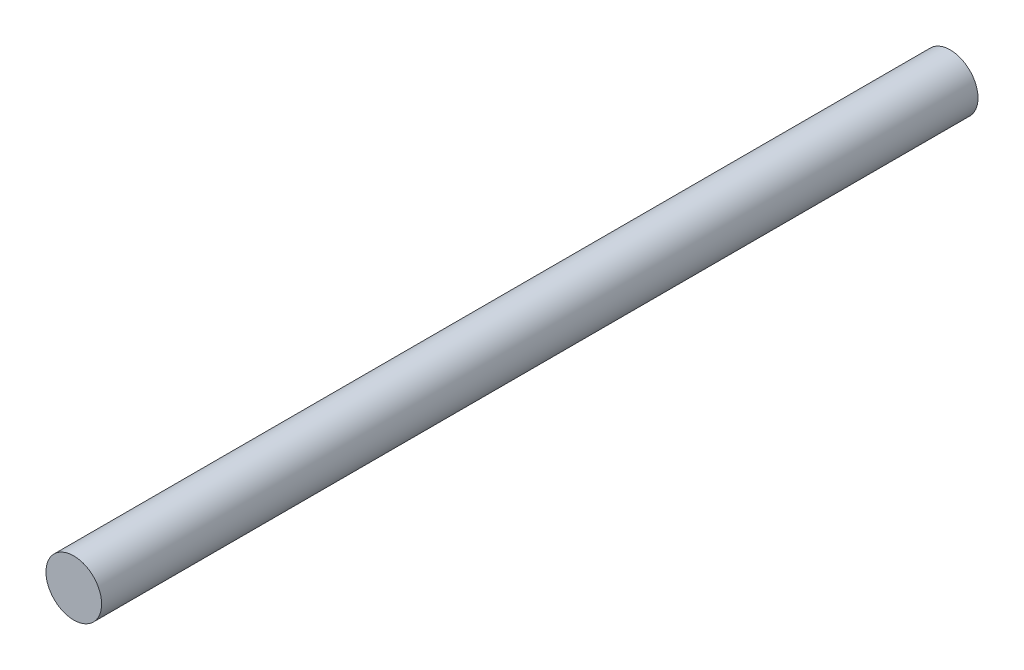
ISO-10303-21;
HEADER;
FILE_DESCRIPTION(('STEP AP214'),'2;1');
FILE_NAME('part.step','',(''),(''),'','','');
FILE_SCHEMA(('AUTOMOTIVE_DESIGN { 1 0 10303 214 1 1 1 1 }'));
ENDSEC;
DATA;
#1=APPLICATION_CONTEXT('core data for automotive mechanical design processes');
#2=APPLICATION_PROTOCOL_DEFINITION('international standard','automotive_design',2000,#1);
#3=PRODUCT_CONTEXT('',#1,'mechanical');
#4=PRODUCT('Part','Part','',(#3));
#5=PRODUCT_RELATED_PRODUCT_CATEGORY('part','',(#4));
#6=PRODUCT_DEFINITION_FORMATION('','',#4);
#7=PRODUCT_DEFINITION_CONTEXT('part definition',#1,'design');
#8=PRODUCT_DEFINITION('design','',#6,#7);
#9=PRODUCT_DEFINITION_SHAPE('','',#8);
#10=(LENGTH_UNIT() NAMED_UNIT(*) SI_UNIT(.MILLI.,.METRE.));
#11=(NAMED_UNIT(*) PLANE_ANGLE_UNIT() SI_UNIT($,.RADIAN.));
#12=(NAMED_UNIT(*) SI_UNIT($,.STERADIAN.) SOLID_ANGLE_UNIT());
#13=UNCERTAINTY_MEASURE_WITH_UNIT(LENGTH_MEASURE(1.E-05),#10,'distance_accuracy_value','');
#14=(GEOMETRIC_REPRESENTATION_CONTEXT(3) GLOBAL_UNCERTAINTY_ASSIGNED_CONTEXT((#13)) GLOBAL_UNIT_ASSIGNED_CONTEXT((#10,
#11,#12)) REPRESENTATION_CONTEXT('',''));
#15=CARTESIAN_POINT('',(0.,0.,0.));
#16=DIRECTION('',(0.,0.,1.));
#17=DIRECTION('',(1.,0.,0.));
#18=AXIS2_PLACEMENT_3D('',#15,#16,#17);
#19=CARTESIAN_POINT('',(0.,0.,100.));
#20=DIRECTION('',(0.,0.,-1.));
#21=DIRECTION('',(-1.,0.,0.));
#22=AXIS2_PLACEMENT_3D('',#19,#20,#21);
#23=CYLINDRICAL_SURFACE('',#22,3.175);
#24=CARTESIAN_POINT('',(0.,0.,100.));
#25=DIRECTION('',(0.,0.,1.));
#26=DIRECTION('',(1.,0.,0.));
#27=AXIS2_PLACEMENT_3D('',#24,#25,#26);
#28=CIRCLE('',#27,3.175);
#29=CARTESIAN_POINT('',(3.175,0.,100.));
#30=VERTEX_POINT('',#29);
#31=EDGE_CURVE('E10',#30,#30,#28,.T.);
#32=ORIENTED_EDGE('',*,*,#31,.F.);
#33=EDGE_LOOP('',(#32));
#34=FACE_BOUND('',#33,.T.);
#35=CARTESIAN_POINT('',(0.,0.,0.));
#36=DIRECTION('',(0.,0.,1.));
#37=DIRECTION('',(1.,0.,0.));
#38=AXIS2_PLACEMENT_3D('',#35,#36,#37);
#39=CIRCLE('',#38,3.175);
#40=CARTESIAN_POINT('',(3.175,0.,0.));
#41=VERTEX_POINT('',#40);
#42=EDGE_CURVE('E34',#41,#41,#39,.T.);
#43=ORIENTED_EDGE('',*,*,#42,.T.);
#44=EDGE_LOOP('',(#43));
#45=FACE_BOUND('',#44,.T.);
#46=ADVANCED_FACE('F31',(#34,#45),#23,.T.);
#47=CARTESIAN_POINT('',(0.,0.,100.));
#48=DIRECTION('',(0.,0.,1.));
#49=DIRECTION('',(1.,0.,0.));
#50=AXIS2_PLACEMENT_3D('',#47,#48,#49);
#51=PLANE('',#50);
#52=ORIENTED_EDGE('',*,*,#31,.T.);
#53=EDGE_LOOP('',(#52));
#54=FACE_BOUND('',#53,.T.);
#55=ADVANCED_FACE('F46',(#54),#51,.T.);
#56=CARTESIAN_POINT('',(0.,0.,0.));
#57=DIRECTION('',(0.,0.,1.));
#58=DIRECTION('',(1.,0.,0.));
#59=AXIS2_PLACEMENT_3D('',#56,#57,#58);
#60=PLANE('',#59);
#61=ORIENTED_EDGE('',*,*,#42,.F.);
#62=EDGE_LOOP('',(#61));
#63=FACE_BOUND('',#62,.T.);
#64=ADVANCED_FACE('F44',(#63),#60,.F.);
#65=CLOSED_SHELL('',(#46,#55,#64));
#66=MANIFOLD_SOLID_BREP('B2',#65);
#67=ADVANCED_BREP_SHAPE_REPRESENTATION('',(#18,#66),#14);
#68=SHAPE_DEFINITION_REPRESENTATION(#9,#67);
ENDSEC;
END-ISO-10303-21;
